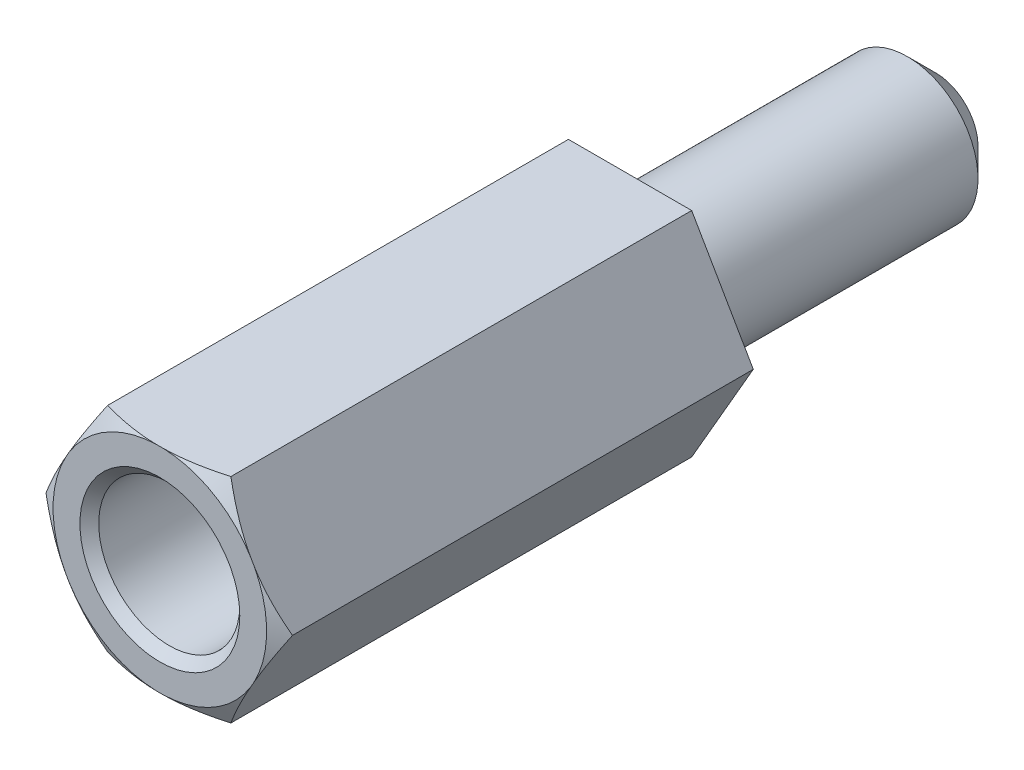
ISO-10303-21;
HEADER;
FILE_DESCRIPTION(('STEP AP214'),'2;1');
FILE_NAME('part.step','',(''),(''),'','','');
FILE_SCHEMA(('AUTOMOTIVE_DESIGN { 1 0 10303 214 1 1 1 1 }'));
ENDSEC;
DATA;
#1=APPLICATION_CONTEXT('core data for automotive mechanical design processes');
#2=APPLICATION_PROTOCOL_DEFINITION('international standard','automotive_design',2000,#1);
#3=PRODUCT_CONTEXT('',#1,'mechanical');
#4=PRODUCT('Part','Part','',(#3));
#5=PRODUCT_RELATED_PRODUCT_CATEGORY('part','',(#4));
#6=PRODUCT_DEFINITION_FORMATION('','',#4);
#7=PRODUCT_DEFINITION_CONTEXT('part definition',#1,'design');
#8=PRODUCT_DEFINITION('design','',#6,#7);
#9=PRODUCT_DEFINITION_SHAPE('','',#8);
#10=(LENGTH_UNIT() NAMED_UNIT(*) SI_UNIT(.MILLI.,.METRE.));
#11=(NAMED_UNIT(*) PLANE_ANGLE_UNIT() SI_UNIT($,.RADIAN.));
#12=(NAMED_UNIT(*) SI_UNIT($,.STERADIAN.) SOLID_ANGLE_UNIT());
#13=UNCERTAINTY_MEASURE_WITH_UNIT(LENGTH_MEASURE(1.E-05),#10,'distance_accuracy_value','');
#14=(GEOMETRIC_REPRESENTATION_CONTEXT(3) GLOBAL_UNCERTAINTY_ASSIGNED_CONTEXT((#13)) GLOBAL_UNIT_ASSIGNED_CONTEXT((#10,
#11,#12)) REPRESENTATION_CONTEXT('',''));
#15=CARTESIAN_POINT('',(0.,0.,0.));
#16=DIRECTION('',(0.,0.,1.));
#17=DIRECTION('',(1.,0.,0.));
#18=AXIS2_PLACEMENT_3D('',#15,#16,#17);
#19=CARTESIAN_POINT('',(0.,0.,10.));
#20=DIRECTION('',(0.,0.,1.));
#21=DIRECTION('',(1.,0.,0.));
#22=AXIS2_PLACEMENT_3D('',#19,#20,#21);
#23=PLANE('',#22);
#24=CARTESIAN_POINT('',(0.,0.,10.));
#25=DIRECTION('',(0.,0.,1.));
#26=DIRECTION('',(1.,0.,0.));
#27=AXIS2_PLACEMENT_3D('',#24,#25,#26);
#28=CIRCLE('',#27,1.7);
#29=CARTESIAN_POINT('',(1.7,0.,10.));
#30=VERTEX_POINT('',#29);
#31=EDGE_CURVE('E162',#30,#30,#28,.F.);
#32=ORIENTED_EDGE('',*,*,#31,.T.);
#33=EDGE_LOOP('',(#32));
#34=FACE_BOUND('',#33,.T.);
#35=CARTESIAN_POINT('',(0.,0.,10.));
#36=DIRECTION('',(0.,0.,1.));
#37=DIRECTION('',(1.,0.,0.));
#38=AXIS2_PLACEMENT_3D('',#35,#36,#37);
#39=CIRCLE('',#38,2.2711702221209);
#40=CARTESIAN_POINT('',(1.92942846272878,-1.19813187298425,10.));
#41=VERTEX_POINT('',#40);
#42=CARTESIAN_POINT('',(0.0728984077241117,-2.27,10.));
#43=VERTEX_POINT('',#42);
#44=EDGE_CURVE('E161',#41,#43,#39,.F.);
#45=ORIENTED_EDGE('',*,*,#44,.F.);
#46=DIRECTION('',(0.499999999999995,0.866025403784442,0.));
#47=VECTOR('',#46,1.);
#48=CARTESIAN_POINT('',(1.31058511106048,-2.26999999999999,10.));
#49=LINE('',#48,#47);
#50=CARTESIAN_POINT('',(2.0023268704526,-1.07186812701573,10.));
#51=VERTEX_POINT('',#50);
#52=EDGE_CURVE('E305',#41,#51,#49,.T.);
#53=ORIENTED_EDGE('',*,*,#52,.T.);
#54=CARTESIAN_POINT('',(2.00232687045272,1.0718681270155,10.));
#55=VERTEX_POINT('',#54);
#56=EDGE_CURVE('E158',#55,#51,#39,.F.);
#57=ORIENTED_EDGE('',*,*,#56,.F.);
#58=DIRECTION('',(-0.500000000000001,0.866025403784438,0.));
#59=VECTOR('',#58,1.);
#60=CARTESIAN_POINT('',(2.6211702221209,0.,10.));
#61=LINE('',#60,#59);
#62=CARTESIAN_POINT('',(1.92942846272862,1.19813187298451,10.));
#63=VERTEX_POINT('',#62);
#64=EDGE_CURVE('E317',#55,#63,#61,.T.);
#65=ORIENTED_EDGE('',*,*,#64,.T.);
#66=CARTESIAN_POINT('',(0.0728984077240801,2.27,10.));
#67=VERTEX_POINT('',#66);
#68=EDGE_CURVE('E160',#67,#63,#39,.F.);
#69=ORIENTED_EDGE('',*,*,#68,.F.);
#70=DIRECTION('',(-1.,0.,0.));
#71=VECTOR('',#70,1.);
#72=CARTESIAN_POINT('',(1.31058511106045,2.27,10.));
#73=LINE('',#72,#71);
#74=CARTESIAN_POINT('',(-0.0728984077240959,2.27,10.));
#75=VERTEX_POINT('',#74);
#76=EDGE_CURVE('E312',#67,#75,#73,.T.);
#77=ORIENTED_EDGE('',*,*,#76,.T.);
#78=CARTESIAN_POINT('',(-1.92942846272864,1.19813187298448,10.));
#79=VERTEX_POINT('',#78);
#80=EDGE_CURVE('E337',#79,#75,#39,.F.);
#81=ORIENTED_EDGE('',*,*,#80,.F.);
#82=DIRECTION('',(-0.499999999999995,-0.866025403784442,0.));
#83=VECTOR('',#82,1.);
#84=CARTESIAN_POINT('',(-1.31058511106046,2.27,10.));
#85=LINE('',#84,#83);
#86=CARTESIAN_POINT('',(-2.00232687045273,1.07186812701549,10.));
#87=VERTEX_POINT('',#86);
#88=EDGE_CURVE('E311',#79,#87,#85,.T.);
#89=ORIENTED_EDGE('',*,*,#88,.T.);
#90=CARTESIAN_POINT('',(-2.00232687045272,-1.07186812701551,10.));
#91=VERTEX_POINT('',#90);
#92=EDGE_CURVE('E122',#91,#87,#39,.F.);
#93=ORIENTED_EDGE('',*,*,#92,.F.);
#94=DIRECTION('',(0.500000000000007,-0.866025403784435,0.));
#95=VECTOR('',#94,1.);
#96=CARTESIAN_POINT('',(-2.6211702221209,0.,10.));
#97=LINE('',#96,#95);
#98=CARTESIAN_POINT('',(-1.92942846272862,-1.19813187298452,10.));
#99=VERTEX_POINT('',#98);
#100=EDGE_CURVE('E138',#91,#99,#97,.T.);
#101=ORIENTED_EDGE('',*,*,#100,.T.);
#102=CARTESIAN_POINT('',(-0.0728984077240643,-2.27,10.));
#103=VERTEX_POINT('',#102);
#104=EDGE_CURVE('E328',#103,#99,#39,.F.);
#105=ORIENTED_EDGE('',*,*,#104,.F.);
#106=DIRECTION('',(1.,0.,0.));
#107=VECTOR('',#106,1.);
#108=CARTESIAN_POINT('',(-1.31058511106043,-2.27000000000001,10.));
#109=LINE('',#108,#107);
#110=EDGE_CURVE('E297',#103,#43,#109,.T.);
#111=ORIENTED_EDGE('',*,*,#110,.T.);
#112=EDGE_LOOP('',(#45,#53,#57,#65,#69,#77,#81,#89,#93,#101,#105,#111));
#113=FACE_BOUND('',#112,.T.);
#114=ADVANCED_FACE('F33',(#34,#113),#23,.T.);
#115=CARTESIAN_POINT('',(1.31058511106048,-2.26999999999999,10.));
#116=DIRECTION('',(-0.866025403784442,0.499999999999995,0.));
#117=DIRECTION('',(-0.499999999999995,-0.866025403784442,0.));
#118=AXIS2_PLACEMENT_3D('',#115,#116,#117);
#119=PLANE('',#118);
#120=DIRECTION('',(0.,0.,-1.));
#121=VECTOR('',#120,1.);
#122=CARTESIAN_POINT('',(2.6211702221209,0.,10.));
#123=LINE('',#122,#121);
#124=CARTESIAN_POINT('',(2.6211702221209,0.,9.8));
#125=VERTEX_POINT('',#124);
#126=CARTESIAN_POINT('',(2.6211702221209,0.,0.));
#127=VERTEX_POINT('',#126);
#128=EDGE_CURVE('E156',#125,#127,#123,.T.);
#129=ORIENTED_EDGE('',*,*,#128,.F.);
#130=CARTESIAN_POINT('',(3.53192502802619,1.5774735970655,9.08741553571821));
#131=CARTESIAN_POINT('',(3.49038683177578,1.50552733070503,9.12584593682828));
#132=CARTESIAN_POINT('',(3.44875020540645,1.43341057837759,9.16385654237284));
#133=CARTESIAN_POINT('',(3.36523806633925,1.28876331046444,9.23884087084839));
#134=CARTESIAN_POINT('',(3.32336252393505,1.21623274342586,9.27581446130191));
#135=CARTESIAN_POINT('',(3.2392041639013,1.07046618796573,9.34863605718441));
#136=CARTESIAN_POINT('',(3.19692046373752,0.99722867095006,9.38448000175645));
#137=CARTESIAN_POINT('',(3.11203872815441,0.850209192285477,9.4546361454567));
#138=CARTESIAN_POINT('',(3.06944070287604,0.776427248201235,9.48894839375192));
#139=CARTESIAN_POINT('',(2.93902958582734,0.550548567601069,9.59073247234418));
#140=CARTESIAN_POINT('',(2.85063034563924,0.397436592244796,9.6552582519314));
#141=CARTESIAN_POINT('',(2.67192637782697,0.0879122404797892,9.77245452535466));
#142=CARTESIAN_POINT('',(2.58162393222904,-0.0684961833435467,9.82513842194361));
#143=CARTESIAN_POINT('',(2.42693241398784,-0.336429752437285,9.89926542993134));
#144=CARTESIAN_POINT('',(2.36310804900724,-0.446976795344509,9.9253337082215));
#145=CARTESIAN_POINT('',(2.23458545503782,-0.669584458020084,9.96667159632339));
#146=CARTESIAN_POINT('',(2.16988756118548,-0.781644497315037,9.98194523398376));
#147=CARTESIAN_POINT('',(2.04077595171339,-1.00527236476769,9.99988363065833));
#148=CARTESIAN_POINT('',(1.97636731130574,-1.11683140240018,10.0026891812466));
#149=CARTESIAN_POINT('',(1.8477221713502,-1.33965132094999,9.99573180979079));
#150=CARTESIAN_POINT('',(1.78348569252728,-1.4509121659706,9.98596743716207));
#151=CARTESIAN_POINT('',(1.63030365883248,-1.71623123113674,9.94884110275405));
#152=CARTESIAN_POINT('',(1.54169424329178,-1.86970724088221,9.91602386301809));
#153=CARTESIAN_POINT('',(1.36642171508064,-2.17328816491496,9.8337386865889));
#154=CARTESIAN_POINT('',(1.2797613139628,-2.32338838265536,9.78424891904423));
#155=CARTESIAN_POINT('',(1.10733311832966,-2.62204277814939,9.67342960435071));
#156=CARTESIAN_POINT('',(1.02158612689552,-2.77056092390949,9.61197390522855));
#157=CARTESIAN_POINT('',(0.851622526986732,-3.06494651438883,9.48148391942089));
#158=CARTESIAN_POINT('',(0.767405153907318,-3.21081528344236,9.41245354776721));
#159=CARTESIAN_POINT('',(0.635892107966437,-3.43860256087011,9.29990584898818));
#160=CARTESIAN_POINT('',(0.588222071353345,-3.52116948628265,9.25811500866701));
#161=CARTESIAN_POINT('',(0.493605207664321,-3.68505070144486,9.17352418104969));
#162=CARTESIAN_POINT('',(0.44665570074096,-3.76636963282643,9.13073619973541));
#163=CARTESIAN_POINT('',(0.399830305155195,-3.84747359706549,9.08741553571821));
#164=B_SPLINE_CURVE_WITH_KNOTS('',3,(#130,#131,#132,#133,#134,#135,#136,#137,#138,#139,#140,
#141,#142,#143,#144,#145,#146,#147,#148,#149,#150,#151,#152,#153,#154,#155,#156,#157,#158,#159,
#160,#161,#162,#163),.UNSPECIFIED.,.F.,.F.,(4,2,2,2,2,2,2,2,2,2,2,2,2,2,2,2,4),(0.,
0.27460604883212,0.549247019939764,0.824783021018253,1.10031017110166,1.66467514911564,
2.22839812072204,2.61888273310891,3.00922156533173,3.39514124414461,3.78110546255822,
4.32061090335234,4.86082553106844,5.40707820220988,5.95304985633492,6.26533246804872,
6.57488685439788),.UNSPECIFIED.);
#165=EDGE_CURVE('E295',#125,#51,#164,.T.);
#166=ORIENTED_EDGE('',*,*,#165,.T.);
#167=ORIENTED_EDGE('',*,*,#52,.F.);
#168=CARTESIAN_POINT('',(1.31058511106048,-2.26999999999999,9.8));
#169=VERTEX_POINT('',#168);
#170=EDGE_CURVE('E139',#41,#169,#164,.T.);
#171=ORIENTED_EDGE('',*,*,#170,.T.);
#172=DIRECTION('',(0.,0.,-1.));
#173=VECTOR('',#172,1.);
#174=CARTESIAN_POINT('',(1.31058511106048,-2.26999999999999,10.));
#175=LINE('',#174,#173);
#176=CARTESIAN_POINT('',(1.31058511106048,-2.26999999999999,0.));
#177=VERTEX_POINT('',#176);
#178=EDGE_CURVE('E151',#169,#177,#175,.T.);
#179=ORIENTED_EDGE('',*,*,#178,.T.);
#180=DIRECTION('',(0.499999999999995,0.866025403784442,0.));
#181=VECTOR('',#180,1.);
#182=CARTESIAN_POINT('',(1.31058511106048,-2.26999999999999,0.));
#183=LINE('',#182,#181);
#184=EDGE_CURVE('E283',#177,#127,#183,.T.);
#185=ORIENTED_EDGE('',*,*,#184,.T.);
#186=EDGE_LOOP('',(#129,#166,#167,#171,#179,#185));
#187=FACE_BOUND('',#186,.T.);
#188=ADVANCED_FACE('F244',(#187),#119,.F.);
#189=CARTESIAN_POINT('',(2.6211702221209,0.,10.));
#190=DIRECTION('',(-0.866025403784438,-0.500000000000001,0.));
#191=DIRECTION('',(0.500000000000001,-0.866025403784438,0.));
#192=AXIS2_PLACEMENT_3D('',#189,#190,#191);
#193=PLANE('',#192);
#194=DIRECTION('',(0.,0.,-1.));
#195=VECTOR('',#194,1.);
#196=CARTESIAN_POINT('',(1.31058511106045,2.27,10.));
#197=LINE('',#196,#195);
#198=CARTESIAN_POINT('',(1.31058511106045,2.27,9.8));
#199=VERTEX_POINT('',#198);
#200=CARTESIAN_POINT('',(1.31058511106045,2.27,0.));
#201=VERTEX_POINT('',#200);
#202=EDGE_CURVE('E149',#199,#201,#197,.T.);
#203=ORIENTED_EDGE('',*,*,#202,.F.);
#204=CARTESIAN_POINT('',(0.399830305155138,3.84747359706553,9.08741553571819));
#205=CARTESIAN_POINT('',(0.441368501405547,3.77552733070505,9.12584593682826));
#206=CARTESIAN_POINT('',(0.483005127774877,3.70341057837761,9.16385654237282));
#207=CARTESIAN_POINT('',(0.566517266842073,3.55876331046447,9.23884087084837));
#208=CARTESIAN_POINT('',(0.608392809246276,3.48623274342589,9.2758144613019));
#209=CARTESIAN_POINT('',(0.692551169280028,3.34046618796575,9.34863605718439));
#210=CARTESIAN_POINT('',(0.734834869443804,3.26722867095008,9.38448000175643));
#211=CARTESIAN_POINT('',(0.819716605026919,3.1202091922855,9.45463614545669));
#212=CARTESIAN_POINT('',(0.86231463030529,3.04642724820126,9.4889483937519));
#213=CARTESIAN_POINT('',(0.992725747353993,2.8205485676011,9.59073247234417));
#214=CARTESIAN_POINT('',(1.08112498754209,2.66743659224482,9.65525825193139));
#215=CARTESIAN_POINT('',(1.25982895535436,2.35791224047982,9.77245452535465));
#216=CARTESIAN_POINT('',(1.35013140095229,2.20150381665648,9.8251384219436));
#217=CARTESIAN_POINT('',(1.5048229191935,1.93357024756274,9.89926542993133));
#218=CARTESIAN_POINT('',(1.5686472841741,1.82302320465552,9.92533370822149));
#219=CARTESIAN_POINT('',(1.69716987814352,1.60041554197995,9.96667159632339));
#220=CARTESIAN_POINT('',(1.76186777199586,1.488355502685,9.98194523398376));
#221=CARTESIAN_POINT('',(1.89097938146795,1.26472763523235,9.99988363065833));
#222=CARTESIAN_POINT('',(1.9553880218756,1.15316859759985,10.0026891812466));
#223=CARTESIAN_POINT('',(2.08403316183114,0.930348679050052,9.9957318097908));
#224=CARTESIAN_POINT('',(2.14826964065406,0.819087834029435,9.98596743716208));
#225=CARTESIAN_POINT('',(2.30145167434887,0.553768768863305,9.94884110275407));
#226=CARTESIAN_POINT('',(2.39006108988956,0.400292759117837,9.91602386301811));
#227=CARTESIAN_POINT('',(2.56533361810069,0.0967118350851043,9.83373868658893));
#228=CARTESIAN_POINT('',(2.65199401921854,-0.0533883826552948,9.78424891904426));
#229=CARTESIAN_POINT('',(2.82442221485167,-0.352042778149311,9.67342960435074));
#230=CARTESIAN_POINT('',(2.91016920628581,-0.500560923909414,9.61197390522858));
#231=CARTESIAN_POINT('',(3.0801328061946,-0.794946514388739,9.48148391942094));
#232=CARTESIAN_POINT('',(3.16435017927401,-0.940815283442264,9.41245354776725));
#233=CARTESIAN_POINT('',(3.2958632252149,-1.16860256087003,9.29990584898822));
#234=CARTESIAN_POINT('',(3.34353326182801,-1.2511694862826,9.25811500866704));
#235=CARTESIAN_POINT('',(3.43815012551706,-1.41505070144485,9.17352418104969));
#236=CARTESIAN_POINT('',(3.48509963244043,-1.49636963282644,9.13073619973541));
#237=CARTESIAN_POINT('',(3.53192502802621,-1.57747359706552,9.08741553571819));
#238=B_SPLINE_CURVE_WITH_KNOTS('',3,(#204,#205,#206,#207,#208,#209,#210,#211,#212,#213,#214,
#215,#216,#217,#218,#219,#220,#221,#222,#223,#224,#225,#226,#227,#228,#229,#230,#231,#232,#233,
#234,#235,#236,#237),.UNSPECIFIED.,.F.,.F.,(4,2,2,2,2,2,2,2,2,2,2,2,2,2,2,2,4),(0.,
0.27460604883212,0.549247019939766,0.824783021018256,1.10031017110166,1.66467514911564,
2.22839812072205,2.61888273310891,3.00922156533173,3.39514124414461,3.78110546255822,
4.32061090335232,4.8608255310684,5.40707820220983,5.95304985633486,6.26533246804874,
6.57488685439798),.UNSPECIFIED.);
#239=EDGE_CURVE('E229',#199,#63,#238,.T.);
#240=ORIENTED_EDGE('',*,*,#239,.T.);
#241=ORIENTED_EDGE('',*,*,#64,.F.);
#242=EDGE_CURVE('E326',#55,#125,#238,.T.);
#243=ORIENTED_EDGE('',*,*,#242,.T.);
#244=ORIENTED_EDGE('',*,*,#128,.T.);
#245=DIRECTION('',(-0.500000000000001,0.866025403784438,0.));
#246=VECTOR('',#245,1.);
#247=CARTESIAN_POINT('',(2.6211702221209,0.,0.));
#248=LINE('',#247,#246);
#249=EDGE_CURVE('E288',#127,#201,#248,.T.);
#250=ORIENTED_EDGE('',*,*,#249,.T.);
#251=EDGE_LOOP('',(#203,#240,#241,#243,#244,#250));
#252=FACE_BOUND('',#251,.T.);
#253=ADVANCED_FACE('F239',(#252),#193,.F.);
#254=CARTESIAN_POINT('',(1.31058511106045,2.27,10.));
#255=DIRECTION('',(0.,-1.,0.));
#256=DIRECTION('',(1.,0.,0.));
#257=AXIS2_PLACEMENT_3D('',#254,#255,#256);
#258=PLANE('',#257);
#259=DIRECTION('',(0.,0.,-1.));
#260=VECTOR('',#259,1.);
#261=CARTESIAN_POINT('',(-1.31058511106046,2.27,10.));
#262=LINE('',#261,#260);
#263=CARTESIAN_POINT('',(-1.31058511106046,2.27,9.8));
#264=VERTEX_POINT('',#263);
#265=CARTESIAN_POINT('',(-1.31058511106046,2.27,0.));
#266=VERTEX_POINT('',#265);
#267=EDGE_CURVE('E146',#264,#266,#262,.T.);
#268=ORIENTED_EDGE('',*,*,#267,.F.);
#269=CARTESIAN_POINT('',(-2.88805870812598,2.26999999999999,9.19873241033435));
#270=CARTESIAN_POINT('',(-2.80547290408561,2.26999999999999,9.23582553246422));
#271=CARTESIAN_POINT('',(-2.72266390787582,2.26999999999999,9.27243002780973));
#272=CARTESIAN_POINT('',(-2.55650266128481,2.26999999999999,9.34442495666019));
#273=CARTESIAN_POINT('',(-2.47315031505662,2.26999999999999,9.37981516866865));
#274=CARTESIAN_POINT('',(-2.30548338672953,2.26999999999999,9.44927692229812));
#275=CARTESIAN_POINT('',(-2.22116623150816,2.26999999999999,9.48334228843962));
#276=CARTESIAN_POINT('',(-2.0518277990544,2.26999999999999,9.54965954573777));
#277=CARTESIAN_POINT('',(-1.96680655448942,2.26999999999999,9.58191152049491));
#278=CARTESIAN_POINT('',(-1.71138311857314,2.26999999999999,9.67506560418586));
#279=CARTESIAN_POINT('',(-1.53976972748374,2.26999999999999,9.73272686586935));
#280=CARTESIAN_POINT('',(-1.19280228070999,2.27,9.83494216041644));
#281=CARTESIAN_POINT('',(-1.01745424532613,2.27,9.87951579480202));
#282=CARTESIAN_POINT('',(-0.712090771389105,2.27,9.94007199547372));
#283=CARTESIAN_POINT('',(-0.582987722953642,2.27,9.96055533863026));
#284=CARTESIAN_POINT('',(-0.323439084569074,2.27,9.98958123352197));
#285=CARTESIAN_POINT('',(-0.192993977067367,2.27,9.99812793490839));
#286=CARTESIAN_POINT('',(0.0680599454393529,2.27,10.0022273630874));
#287=CARTESIAN_POINT('',(0.198668678458156,2.27,9.9977850727737));
#288=CARTESIAN_POINT('',(0.458851198221899,2.27,9.97648569269903));
#289=CARTESIAN_POINT('',(0.588424742955648,2.27,9.95962578105719));
#290=CARTESIAN_POINT('',(0.90493775296269,2.27,9.90516079530181));
#291=CARTESIAN_POINT('',(1.09083477493519,2.27,9.86157940431848));
#292=CARTESIAN_POINT('',(1.36639728986907,2.27,9.78449647659567));
#293=CARTESIAN_POINT('',(1.45781153661094,2.27,9.75681025363438));
#294=CARTESIAN_POINT('',(1.63961899594479,2.27000000000001,9.69825910905325));
#295=CARTESIAN_POINT('',(1.73001229033942,2.27000000000001,9.6673944441364));
#296=CARTESIAN_POINT('',(1.91077257487059,2.27000000000001,9.60278371414741));
#297=CARTESIAN_POINT('',(2.00113026057095,2.27000000000001,9.56901191899239));
#298=CARTESIAN_POINT('',(2.18103313876786,2.27000000000001,9.49936027894403));
#299=CARTESIAN_POINT('',(2.27057828364602,2.27000000000001,9.46348031141209));
#300=CARTESIAN_POINT('',(2.44846011178724,2.27000000000001,9.3902269588395));
#301=CARTESIAN_POINT('',(2.53680076536778,2.27000000000001,9.35286316680602));
#302=CARTESIAN_POINT('',(2.71286376090328,2.27000000000001,9.2767584059864));
#303=CARTESIAN_POINT('',(2.80058623966965,2.27000000000001,9.2380177541729));
#304=CARTESIAN_POINT('',(2.88805870812597,2.27000000000001,9.19873241033435));
#305=B_SPLINE_CURVE_WITH_KNOTS('',3,(#269,#270,#271,#272,#273,#274,#275,#276,#277,#278,#279,
#280,#281,#282,#283,#284,#285,#286,#287,#288,#289,#290,#291,#292,#293,#294,#295,#296,#297,#298,
#299,#300,#301,#302,#303,#304),.UNSPECIFIED.,.F.,.F.,(4,2,2,2,2,2,2,2,2,2,2,2,2,2,2,2,2,4),(0.,
0.271603728461575,0.543256739373971,0.816052841064956,1.08883635604999,1.63163153509609,
2.17360956621751,2.56530041766828,2.95685506788357,3.3482595279036,3.73975296129815,
4.311415664863,4.59793246001126,4.88442613310068,5.17378506531957,5.46316084709716,
5.75090015934329,6.03857365362724),.UNSPECIFIED.);
#306=EDGE_CURVE('E221',#264,#75,#305,.T.);
#307=ORIENTED_EDGE('',*,*,#306,.T.);
#308=ORIENTED_EDGE('',*,*,#76,.F.);
#309=EDGE_CURVE('E228',#67,#199,#305,.T.);
#310=ORIENTED_EDGE('',*,*,#309,.T.);
#311=ORIENTED_EDGE('',*,*,#202,.T.);
#312=DIRECTION('',(-1.,0.,0.));
#313=VECTOR('',#312,1.);
#314=CARTESIAN_POINT('',(1.31058511106045,2.27,0.));
#315=LINE('',#314,#313);
#316=EDGE_CURVE('E292',#201,#266,#315,.T.);
#317=ORIENTED_EDGE('',*,*,#316,.T.);
#318=EDGE_LOOP('',(#268,#307,#308,#310,#311,#317));
#319=FACE_BOUND('',#318,.T.);
#320=ADVANCED_FACE('F236',(#319),#258,.F.);
#321=CARTESIAN_POINT('',(-1.31058511106046,2.27,10.));
#322=DIRECTION('',(0.866025403784442,-0.499999999999995,0.));
#323=DIRECTION('',(0.499999999999995,0.866025403784442,0.));
#324=AXIS2_PLACEMENT_3D('',#321,#322,#323);
#325=PLANE('',#324);
#326=DIRECTION('',(0.,0.,-1.));
#327=VECTOR('',#326,1.);
#328=CARTESIAN_POINT('',(-2.6211702221209,0.,10.));
#329=LINE('',#328,#327);
#330=CARTESIAN_POINT('',(-2.6211702221209,0.,9.8));
#331=VERTEX_POINT('',#330);
#332=CARTESIAN_POINT('',(-2.6211702221209,0.,0.));
#333=VERTEX_POINT('',#332);
#334=EDGE_CURVE('E134',#331,#333,#329,.T.);
#335=ORIENTED_EDGE('',*,*,#334,.F.);
#336=CARTESIAN_POINT('',(-3.5319250280262,-1.57747359706554,9.08741553571819));
#337=CARTESIAN_POINT('',(-3.49038683177579,-1.50552733070506,9.12584593682826));
#338=CARTESIAN_POINT('',(-3.44875020540646,-1.43341057837762,9.16385654237283));
#339=CARTESIAN_POINT('',(-3.36523806633926,-1.28876331046448,9.23884087084837));
#340=CARTESIAN_POINT('',(-3.32336252393506,-1.2162327434259,9.2758144613019));
#341=CARTESIAN_POINT('',(-3.23920416390131,-1.07046618796576,9.34863605718439));
#342=CARTESIAN_POINT('',(-3.19692046373754,-0.997228670950096,9.38448000175644));
#343=CARTESIAN_POINT('',(-3.11203872815442,-0.850209192285514,9.45463614545669));
#344=CARTESIAN_POINT('',(-3.06944070287605,-0.776427248201272,9.4889483937519));
#345=CARTESIAN_POINT('',(-2.93902958582735,-0.550548567601106,9.59073247234417));
#346=CARTESIAN_POINT('',(-2.85063034563925,-0.397436592244833,9.65525825193139));
#347=CARTESIAN_POINT('',(-2.67192637782698,-0.0879122404798262,9.77245452535465));
#348=CARTESIAN_POINT('',(-2.58162393222906,0.0684961833435103,9.8251384219436));
#349=CARTESIAN_POINT('',(-2.42693241398785,0.336429752437248,9.89926542993133));
#350=CARTESIAN_POINT('',(-2.36310804900725,0.446976795344472,9.92533370822149));
#351=CARTESIAN_POINT('',(-2.23458545503783,0.669584458020046,9.96667159632339));
#352=CARTESIAN_POINT('',(-2.16988756118549,0.781644497314998,9.98194523398376));
#353=CARTESIAN_POINT('',(-2.04077595171341,1.00527236476765,9.99988363065833));
#354=CARTESIAN_POINT('',(-1.97636731130575,1.11683140240014,10.0026891812466));
#355=CARTESIAN_POINT('',(-1.84772217135021,1.33965132094994,9.9957318097908));
#356=CARTESIAN_POINT('',(-1.7834856925273,1.45091216597056,9.98596743716208));
#357=CARTESIAN_POINT('',(-1.63030365883249,1.71623123113669,9.94884110275407));
#358=CARTESIAN_POINT('',(-1.5416942432918,1.86970724088216,9.91602386301811));
#359=CARTESIAN_POINT('',(-1.36642171508067,2.1732881649149,9.83373868658892));
#360=CARTESIAN_POINT('',(-1.27976131396282,2.3233883826553,9.78424891904425));
#361=CARTESIAN_POINT('',(-1.10733311832969,2.62204277814932,9.67342960435074));
#362=CARTESIAN_POINT('',(-1.02158612689555,2.77056092390942,9.61197390522858));
#363=CARTESIAN_POINT('',(-0.851622526986768,3.06494651438875,9.48148391942093));
#364=CARTESIAN_POINT('',(-0.767405153907355,3.21081528344228,9.41245354776725));
#365=CARTESIAN_POINT('',(-0.635892107966466,3.43860256087004,9.29990584898822));
#366=CARTESIAN_POINT('',(-0.588222071353362,3.5211694862826,9.25811500866704));
#367=CARTESIAN_POINT('',(-0.493605207664316,3.68505070144485,9.17352418104969));
#368=CARTESIAN_POINT('',(-0.446655700740943,3.76636963282644,9.13073619973541));
#369=CARTESIAN_POINT('',(-0.399830305155168,3.84747359706552,9.08741553571819));
#370=B_SPLINE_CURVE_WITH_KNOTS('',3,(#336,#337,#338,#339,#340,#341,#342,#343,#344,#345,#346,
#347,#348,#349,#350,#351,#352,#353,#354,#355,#356,#357,#358,#359,#360,#361,#362,#363,#364,#365,
#366,#367,#368,#369),.UNSPECIFIED.,.F.,.F.,(4,2,2,2,2,2,2,2,2,2,2,2,2,2,2,2,4),(0.,
0.27460604883212,0.549247019939765,0.824783021018254,1.10031017110166,1.66467514911564,
2.22839812072205,2.61888273310891,3.00922156533173,3.39514124414461,3.78110546255822,
4.32061090335232,4.86082553106841,5.40707820220984,5.95304985633486,6.26533246804873,
6.57488685439796),.UNSPECIFIED.);
#371=EDGE_CURVE('E120',#331,#87,#370,.T.);
#372=ORIENTED_EDGE('',*,*,#371,.T.);
#373=ORIENTED_EDGE('',*,*,#88,.F.);
#374=EDGE_CURVE('E127',#79,#264,#370,.T.);
#375=ORIENTED_EDGE('',*,*,#374,.T.);
#376=ORIENTED_EDGE('',*,*,#267,.T.);
#377=DIRECTION('',(-0.499999999999995,-0.866025403784442,0.));
#378=VECTOR('',#377,1.);
#379=CARTESIAN_POINT('',(-1.31058511106046,2.27,0.));
#380=LINE('',#379,#378);
#381=EDGE_CURVE('E144',#266,#333,#380,.T.);
#382=ORIENTED_EDGE('',*,*,#381,.T.);
#383=EDGE_LOOP('',(#335,#372,#373,#375,#376,#382));
#384=FACE_BOUND('',#383,.T.);
#385=ADVANCED_FACE('F142',(#384),#325,.F.);
#386=CARTESIAN_POINT('',(-2.6211702221209,0.,10.));
#387=DIRECTION('',(0.866025403784435,0.500000000000007,0.));
#388=DIRECTION('',(-0.500000000000007,0.866025403784435,0.));
#389=AXIS2_PLACEMENT_3D('',#386,#387,#388);
#390=PLANE('',#389);
#391=DIRECTION('',(0.,0.,-1.));
#392=VECTOR('',#391,1.);
#393=CARTESIAN_POINT('',(-1.31058511106043,-2.27000000000001,10.));
#394=LINE('',#393,#392);
#395=CARTESIAN_POINT('',(-1.31058511106043,-2.27000000000001,9.8));
#396=VERTEX_POINT('',#395);
#397=CARTESIAN_POINT('',(-1.31058511106043,-2.27000000000001,0.));
#398=VERTEX_POINT('',#397);
#399=EDGE_CURVE('E147',#396,#398,#394,.T.);
#400=ORIENTED_EDGE('',*,*,#399,.F.);
#401=CARTESIAN_POINT('',(-0.399830305155107,-3.84747359706554,9.08741553571818));
#402=CARTESIAN_POINT('',(-0.441368501405516,-3.77552733070506,9.12584593682825));
#403=CARTESIAN_POINT('',(-0.483005127774847,-3.70341057837762,9.16385654237282));
#404=CARTESIAN_POINT('',(-0.566517266842044,-3.55876331046448,9.23884087084837));
#405=CARTESIAN_POINT('',(-0.608392809246247,-3.4862327434259,9.27581446130189));
#406=CARTESIAN_POINT('',(-0.692551169280001,-3.34046618796576,9.34863605718439));
#407=CARTESIAN_POINT('',(-0.734834869443777,-3.2672286709501,9.38448000175643));
#408=CARTESIAN_POINT('',(-0.819716605026894,-3.12020919228551,9.45463614545668));
#409=CARTESIAN_POINT('',(-0.862314630305265,-3.04642724820127,9.4889483937519));
#410=CARTESIAN_POINT('',(-0.99272574735397,-2.82054856760111,9.59073247234417));
#411=CARTESIAN_POINT('',(-1.08112498754207,-2.66743659224484,9.65525825193139));
#412=CARTESIAN_POINT('',(-1.25982895535434,-2.35791224047983,9.77245452535464));
#413=CARTESIAN_POINT('',(-1.35013140095227,-2.2015038166565,9.8251384219436));
#414=CARTESIAN_POINT('',(-1.50482291919348,-1.93357024756276,9.89926542993133));
#415=CARTESIAN_POINT('',(-1.56864728417409,-1.82302320465554,9.92533370822149));
#416=CARTESIAN_POINT('',(-1.6971698781435,-1.60041554197997,9.96667159632339));
#417=CARTESIAN_POINT('',(-1.76186777199584,-1.48835550268501,9.98194523398376));
#418=CARTESIAN_POINT('',(-1.89097938146793,-1.26472763523237,9.99988363065834));
#419=CARTESIAN_POINT('',(-1.95538802187559,-1.15316859759987,10.0026891812466));
#420=CARTESIAN_POINT('',(-2.08403316183113,-0.930348679050071,9.9957318097908));
#421=CARTESIAN_POINT('',(-2.14826964065405,-0.819087834029454,9.98596743716208));
#422=CARTESIAN_POINT('',(-2.30145167434886,-0.553768768863325,9.94884110275407));
#423=CARTESIAN_POINT('',(-2.39006108988956,-0.400292759117858,9.91602386301811));
#424=CARTESIAN_POINT('',(-2.56533361810069,-0.0967118350851267,9.83373868658893));
#425=CARTESIAN_POINT('',(-2.65199401921853,0.0533883826552715,9.78424891904426));
#426=CARTESIAN_POINT('',(-2.82442221485167,0.352042778149285,9.67342960435074));
#427=CARTESIAN_POINT('',(-2.91016920628581,0.500560923909388,9.61197390522858));
#428=CARTESIAN_POINT('',(-3.0801328061946,0.79494651438871,9.48148391942094));
#429=CARTESIAN_POINT('',(-3.16435017927401,0.940815283442235,9.41245354776725));
#430=CARTESIAN_POINT('',(-3.29586322521491,1.16860256087,9.29990584898822));
#431=CARTESIAN_POINT('',(-3.34353326182801,1.25116948628257,9.25811500866704));
#432=CARTESIAN_POINT('',(-3.43815012551707,1.41505070144483,9.17352418104969));
#433=CARTESIAN_POINT('',(-3.48509963244045,1.49636963282642,9.1307361997354));
#434=CARTESIAN_POINT('',(-3.53192502802623,1.57747359706551,9.08741553571819));
#435=B_SPLINE_CURVE_WITH_KNOTS('',3,(#401,#402,#403,#404,#405,#406,#407,#408,#409,#410,#411,
#412,#413,#414,#415,#416,#417,#418,#419,#420,#421,#422,#423,#424,#425,#426,#427,#428,#429,#430,
#431,#432,#433,#434),.UNSPECIFIED.,.F.,.F.,(4,2,2,2,2,2,2,2,2,2,2,2,2,2,2,2,4),(0.,
0.27460604883212,0.549247019939766,0.824783021018256,1.10031017110166,1.66467514911564,
2.22839812072205,2.61888273310892,3.00922156533174,3.39514124414461,3.78110546255822,
4.32061090335232,4.86082553106841,5.40707820220984,5.95304985633486,6.26533246804875,
6.57488685439799),.UNSPECIFIED.);
#436=EDGE_CURVE('E141',#396,#99,#435,.T.);
#437=ORIENTED_EDGE('',*,*,#436,.T.);
#438=ORIENTED_EDGE('',*,*,#100,.F.);
#439=EDGE_CURVE('E56',#91,#331,#435,.T.);
#440=ORIENTED_EDGE('',*,*,#439,.T.);
#441=ORIENTED_EDGE('',*,*,#334,.T.);
#442=DIRECTION('',(0.500000000000007,-0.866025403784435,0.));
#443=VECTOR('',#442,1.);
#444=CARTESIAN_POINT('',(-2.6211702221209,0.,0.));
#445=LINE('',#444,#443);
#446=EDGE_CURVE('E303',#333,#398,#445,.T.);
#447=ORIENTED_EDGE('',*,*,#446,.T.);
#448=EDGE_LOOP('',(#400,#437,#438,#440,#441,#447));
#449=FACE_BOUND('',#448,.T.);
#450=ADVANCED_FACE('F132',(#449),#390,.F.);
#451=CARTESIAN_POINT('',(-1.31058511106043,-2.27000000000001,10.));
#452=DIRECTION('',(0.,1.,0.));
#453=DIRECTION('',(-1.,0.,0.));
#454=AXIS2_PLACEMENT_3D('',#451,#452,#453);
#455=PLANE('',#454);
#456=ORIENTED_EDGE('',*,*,#178,.F.);
#457=CARTESIAN_POINT('',(2.888058708126,-2.26999999999997,9.19873241033435));
#458=CARTESIAN_POINT('',(2.80547290408563,-2.26999999999997,9.23582553246422));
#459=CARTESIAN_POINT('',(2.72266390787583,-2.26999999999997,9.27243002780973));
#460=CARTESIAN_POINT('',(2.55650266128482,-2.26999999999997,9.34442495666019));
#461=CARTESIAN_POINT('',(2.47315031505664,-2.26999999999997,9.37981516866865));
#462=CARTESIAN_POINT('',(2.30548338672954,-2.26999999999998,9.44927692229812));
#463=CARTESIAN_POINT('',(2.22116623150817,-2.26999999999998,9.48334228843962));
#464=CARTESIAN_POINT('',(2.05182779905441,-2.26999999999998,9.54965954573777));
#465=CARTESIAN_POINT('',(1.96680655448944,-2.26999999999998,9.58191152049491));
#466=CARTESIAN_POINT('',(1.71138311857315,-2.26999999999998,9.67506560418586));
#467=CARTESIAN_POINT('',(1.53976972748375,-2.26999999999998,9.73272686586935));
#468=CARTESIAN_POINT('',(1.19280228071001,-2.26999999999999,9.83494216041644));
#469=CARTESIAN_POINT('',(1.01745424532615,-2.26999999999999,9.87951579480201));
#470=CARTESIAN_POINT('',(0.712090771389121,-2.26999999999999,9.94007199547372));
#471=CARTESIAN_POINT('',(0.582987722953657,-2.26999999999999,9.96055533863026));
#472=CARTESIAN_POINT('',(0.32343908456909,-2.27,9.98958123352197));
#473=CARTESIAN_POINT('',(0.192993977067383,-2.27,9.99812793490839));
#474=CARTESIAN_POINT('',(-0.0680599454393371,-2.27,10.0022273630874));
#475=CARTESIAN_POINT('',(-0.19866867845814,-2.27,9.9977850727737));
#476=CARTESIAN_POINT('',(-0.458851198221883,-2.27,9.97648569269903));
#477=CARTESIAN_POINT('',(-0.588424742955632,-2.27000000000001,9.95962578105719));
#478=CARTESIAN_POINT('',(-0.904937752962675,-2.27000000000001,9.90516079530181));
#479=CARTESIAN_POINT('',(-1.09083477493517,-2.27000000000001,9.86157940431848));
#480=CARTESIAN_POINT('',(-1.36639728986905,-2.27000000000001,9.78449647659567));
#481=CARTESIAN_POINT('',(-1.45781153661093,-2.27000000000002,9.75681025363438));
#482=CARTESIAN_POINT('',(-1.63961899594477,-2.27000000000002,9.69825910905325));
#483=CARTESIAN_POINT('',(-1.73001229033941,-2.27000000000002,9.6673944441364));
#484=CARTESIAN_POINT('',(-1.91077257487058,-2.27000000000002,9.6027837141474));
#485=CARTESIAN_POINT('',(-2.00113026057094,-2.27000000000002,9.56901191899239));
#486=CARTESIAN_POINT('',(-2.18103313876785,-2.27000000000002,9.49936027894403));
#487=CARTESIAN_POINT('',(-2.27057828364601,-2.27000000000002,9.46348031141209));
#488=CARTESIAN_POINT('',(-2.44846011178723,-2.27000000000003,9.3902269588395));
#489=CARTESIAN_POINT('',(-2.53680076536776,-2.27000000000003,9.35286316680602));
#490=CARTESIAN_POINT('',(-2.71286376090327,-2.27000000000003,9.2767584059864));
#491=CARTESIAN_POINT('',(-2.80058623966963,-2.27000000000003,9.2380177541729));
#492=CARTESIAN_POINT('',(-2.88805870812595,-2.27000000000003,9.19873241033435));
#493=B_SPLINE_CURVE_WITH_KNOTS('',3,(#457,#458,#459,#460,#461,#462,#463,#464,#465,#466,#467,
#468,#469,#470,#471,#472,#473,#474,#475,#476,#477,#478,#479,#480,#481,#482,#483,#484,#485,#486,
#487,#488,#489,#490,#491,#492),.UNSPECIFIED.,.F.,.F.,(4,2,2,2,2,2,2,2,2,2,2,2,2,2,2,2,2,4),(0.,
0.271603728461575,0.543256739373971,0.816052841064956,1.08883635604999,1.63163153509609,
2.17360956621751,2.56530041766828,2.95685506788357,3.3482595279036,3.73975296129815,
4.311415664863,4.59793246001126,4.88442613310068,5.17378506531957,5.46316084709716,
5.75090015934329,6.03857365362724),.UNSPECIFIED.);
#494=EDGE_CURVE('E182',#169,#43,#493,.T.);
#495=ORIENTED_EDGE('',*,*,#494,.T.);
#496=ORIENTED_EDGE('',*,*,#110,.F.);
#497=EDGE_CURVE('E48',#103,#396,#493,.T.);
#498=ORIENTED_EDGE('',*,*,#497,.T.);
#499=ORIENTED_EDGE('',*,*,#399,.T.);
#500=DIRECTION('',(1.,0.,0.));
#501=VECTOR('',#500,1.);
#502=CARTESIAN_POINT('',(-1.31058511106043,-2.27000000000001,0.));
#503=LINE('',#502,#501);
#504=EDGE_CURVE('E285',#398,#177,#503,.T.);
#505=ORIENTED_EDGE('',*,*,#504,.T.);
#506=EDGE_LOOP('',(#456,#495,#496,#498,#499,#505));
#507=FACE_BOUND('',#506,.T.);
#508=ADVANCED_FACE('F189',(#507),#455,.F.);
#509=CARTESIAN_POINT('',(0.,0.,0.));
#510=DIRECTION('',(0.,0.,1.));
#511=DIRECTION('',(1.,0.,0.));
#512=AXIS2_PLACEMENT_3D('',#509,#510,#511);
#513=PLANE('',#512);
#514=CARTESIAN_POINT('',(0.,0.,0.));
#515=DIRECTION('',(0.,0.,-1.));
#516=DIRECTION('',(-1.,0.,0.));
#517=AXIS2_PLACEMENT_3D('',#514,#515,#516);
#518=CIRCLE('',#517,1.5);
#519=CARTESIAN_POINT('',(-1.5,0.,0.));
#520=VERTEX_POINT('',#519);
#521=EDGE_CURVE('E167',#520,#520,#518,.T.);
#522=ORIENTED_EDGE('',*,*,#521,.F.);
#523=EDGE_LOOP('',(#522));
#524=FACE_BOUND('',#523,.T.);
#525=ORIENTED_EDGE('',*,*,#184,.F.);
#526=ORIENTED_EDGE('',*,*,#504,.F.);
#527=ORIENTED_EDGE('',*,*,#446,.F.);
#528=ORIENTED_EDGE('',*,*,#381,.F.);
#529=ORIENTED_EDGE('',*,*,#316,.F.);
#530=ORIENTED_EDGE('',*,*,#249,.F.);
#531=EDGE_LOOP('',(#525,#526,#527,#528,#529,#530));
#532=FACE_BOUND('',#531,.T.);
#533=ADVANCED_FACE('F269',(#524,#532),#513,.F.);
#534=CARTESIAN_POINT('',(0.,0.,10.000012));
#535=DIRECTION('',(0.,0.,-1.));
#536=DIRECTION('',(-1.,0.,0.));
#537=AXIS2_PLACEMENT_3D('',#534,#535,#536);
#538=CYLINDRICAL_SURFACE('',#537,1.5);
#539=CARTESIAN_POINT('',(0.,0.,9.8));
#540=DIRECTION('',(0.,0.,1.));
#541=DIRECTION('',(1.,0.,0.));
#542=AXIS2_PLACEMENT_3D('',#539,#540,#541);
#543=CIRCLE('',#542,1.5);
#544=CARTESIAN_POINT('',(1.5,0.,9.8));
#545=VERTEX_POINT('',#544);
#546=EDGE_CURVE('E165',#545,#545,#543,.T.);
#547=ORIENTED_EDGE('',*,*,#546,.T.);
#548=EDGE_LOOP('',(#547));
#549=FACE_BOUND('',#548,.T.);
#550=CARTESIAN_POINT('',(0.,0.,1.));
#551=DIRECTION('',(0.,0.,1.));
#552=DIRECTION('',(1.,0.,0.));
#553=AXIS2_PLACEMENT_3D('',#550,#551,#552);
#554=CIRCLE('',#553,1.5);
#555=CARTESIAN_POINT('',(1.5,0.,1.));
#556=VERTEX_POINT('',#555);
#557=EDGE_CURVE('E290',#556,#556,#554,.T.);
#558=ORIENTED_EDGE('',*,*,#557,.F.);
#559=EDGE_LOOP('',(#558));
#560=FACE_BOUND('',#559,.T.);
#561=ADVANCED_FACE('F268',(#549,#560),#538,.F.);
#562=CARTESIAN_POINT('',(0.,0.,1.));
#563=DIRECTION('',(0.,0.,1.));
#564=DIRECTION('',(1.,0.,0.));
#565=AXIS2_PLACEMENT_3D('',#562,#563,#564);
#566=PLANE('',#565);
#567=ORIENTED_EDGE('',*,*,#557,.T.);
#568=EDGE_LOOP('',(#567));
#569=FACE_BOUND('',#568,.T.);
#570=ADVANCED_FACE('F198',(#569),#566,.T.);
#571=CARTESIAN_POINT('',(0.,0.,10.));
#572=DIRECTION('',(0.,0.,-1.));
#573=DIRECTION('',(-1.,0.,0.));
#574=AXIS2_PLACEMENT_3D('',#571,#572,#573);
#575=CONICAL_SURFACE('',#574,2.2711702221209,1.05165021254837);
#576=ORIENTED_EDGE('',*,*,#242,.F.);
#577=ORIENTED_EDGE('',*,*,#56,.T.);
#578=ORIENTED_EDGE('',*,*,#165,.F.);
#579=EDGE_LOOP('',(#576,#577,#578));
#580=FACE_BOUND('',#579,.T.);
#581=ADVANCED_FACE('F192',(#580),#575,.T.);
#582=ORIENTED_EDGE('',*,*,#309,.F.);
#583=ORIENTED_EDGE('',*,*,#68,.T.);
#584=ORIENTED_EDGE('',*,*,#239,.F.);
#585=EDGE_LOOP('',(#582,#583,#584));
#586=FACE_BOUND('',#585,.T.);
#587=ADVANCED_FACE('F197',(#586),#575,.T.);
#588=ORIENTED_EDGE('',*,*,#374,.F.);
#589=ORIENTED_EDGE('',*,*,#80,.T.);
#590=ORIENTED_EDGE('',*,*,#306,.F.);
#591=EDGE_LOOP('',(#588,#589,#590));
#592=FACE_BOUND('',#591,.T.);
#593=ADVANCED_FACE('F340',(#592),#575,.T.);
#594=ORIENTED_EDGE('',*,*,#439,.F.);
#595=ORIENTED_EDGE('',*,*,#92,.T.);
#596=ORIENTED_EDGE('',*,*,#371,.F.);
#597=EDGE_LOOP('',(#594,#595,#596));
#598=FACE_BOUND('',#597,.T.);
#599=ADVANCED_FACE('F121',(#598),#575,.T.);
#600=ORIENTED_EDGE('',*,*,#497,.F.);
#601=ORIENTED_EDGE('',*,*,#104,.T.);
#602=ORIENTED_EDGE('',*,*,#436,.F.);
#603=EDGE_LOOP('',(#600,#601,#602));
#604=FACE_BOUND('',#603,.T.);
#605=ADVANCED_FACE('F200',(#604),#575,.T.);
#606=ORIENTED_EDGE('',*,*,#44,.T.);
#607=ORIENTED_EDGE('',*,*,#494,.F.);
#608=ORIENTED_EDGE('',*,*,#170,.F.);
#609=EDGE_LOOP('',(#606,#607,#608));
#610=FACE_BOUND('',#609,.T.);
#611=ADVANCED_FACE('F251',(#610),#575,.T.);
#612=CARTESIAN_POINT('',(0.,0.,10.));
#613=DIRECTION('',(0.,0.,1.));
#614=DIRECTION('',(1.,0.,0.));
#615=AXIS2_PLACEMENT_3D('',#612,#613,#614);
#616=CONICAL_SURFACE('',#615,1.7,0.785398163397442);
#617=ORIENTED_EDGE('',*,*,#546,.F.);
#618=EDGE_LOOP('',(#617));
#619=FACE_BOUND('',#618,.T.);
#620=ORIENTED_EDGE('',*,*,#31,.F.);
#621=EDGE_LOOP('',(#620));
#622=FACE_BOUND('',#621,.T.);
#623=ADVANCED_FACE('F249',(#619,#622),#616,.F.);
#624=CARTESIAN_POINT('',(0.,0.,-6.5));
#625=DIRECTION('',(0.,0.,1.));
#626=DIRECTION('',(1.,0.,0.));
#627=AXIS2_PLACEMENT_3D('',#624,#625,#626);
#628=CYLINDRICAL_SURFACE('',#627,1.5);
#629=CARTESIAN_POINT('',(0.,0.,-5.90000000000001));
#630=DIRECTION('',(0.,0.,-1.));
#631=DIRECTION('',(-1.,0.,0.));
#632=AXIS2_PLACEMENT_3D('',#629,#630,#631);
#633=CIRCLE('',#632,1.5);
#634=CARTESIAN_POINT('',(-1.5,0.,-5.90000000000001));
#635=VERTEX_POINT('',#634);
#636=EDGE_CURVE('E11',#635,#635,#633,.F.);
#637=ORIENTED_EDGE('',*,*,#636,.T.);
#638=EDGE_LOOP('',(#637));
#639=FACE_BOUND('',#638,.T.);
#640=ORIENTED_EDGE('',*,*,#521,.T.);
#641=EDGE_LOOP('',(#640));
#642=FACE_BOUND('',#641,.T.);
#643=ADVANCED_FACE('F201',(#639,#642),#628,.T.);
#644=CARTESIAN_POINT('',(0.,0.,-6.5));
#645=DIRECTION('',(0.,0.,-1.));
#646=DIRECTION('',(-1.,0.,0.));
#647=AXIS2_PLACEMENT_3D('',#644,#645,#646);
#648=PLANE('',#647);
#649=CARTESIAN_POINT('',(0.,0.,-6.5));
#650=DIRECTION('',(0.,0.,-1.));
#651=DIRECTION('',(-1.,0.,0.));
#652=AXIS2_PLACEMENT_3D('',#649,#650,#651);
#653=CIRCLE('',#652,0.90000000000001);
#654=CARTESIAN_POINT('',(-0.90000000000001,0.,-6.5));
#655=VERTEX_POINT('',#654);
#656=EDGE_CURVE('E41',#655,#655,#653,.T.);
#657=ORIENTED_EDGE('',*,*,#656,.T.);
#658=EDGE_LOOP('',(#657));
#659=FACE_BOUND('',#658,.T.);
#660=ADVANCED_FACE('F257',(#659),#648,.T.);
#661=CARTESIAN_POINT('',(0.,0.,-6.5));
#662=DIRECTION('',(0.,0.,1.));
#663=DIRECTION('',(1.,0.,0.));
#664=AXIS2_PLACEMENT_3D('',#661,#662,#663);
#665=CONICAL_SURFACE('',#664,0.90000000000001,0.785398163397445);
#666=ORIENTED_EDGE('',*,*,#636,.F.);
#667=EDGE_LOOP('',(#666));
#668=FACE_BOUND('',#667,.T.);
#669=ORIENTED_EDGE('',*,*,#656,.F.);
#670=EDGE_LOOP('',(#669));
#671=FACE_BOUND('',#670,.T.);
#672=ADVANCED_FACE('F35',(#668,#671),#665,.T.);
#673=CLOSED_SHELL('',(#114,#188,#253,#320,#385,#450,#508,#533,#561,#570,#581,#587,#593,#599,
#605,#611,#623,#643,#660,#672));
#674=MANIFOLD_SOLID_BREP('B2',#673);
#675=ADVANCED_BREP_SHAPE_REPRESENTATION('',(#18,#674),#14);
#676=SHAPE_DEFINITION_REPRESENTATION(#9,#675);
ENDSEC;
END-ISO-10303-21;
